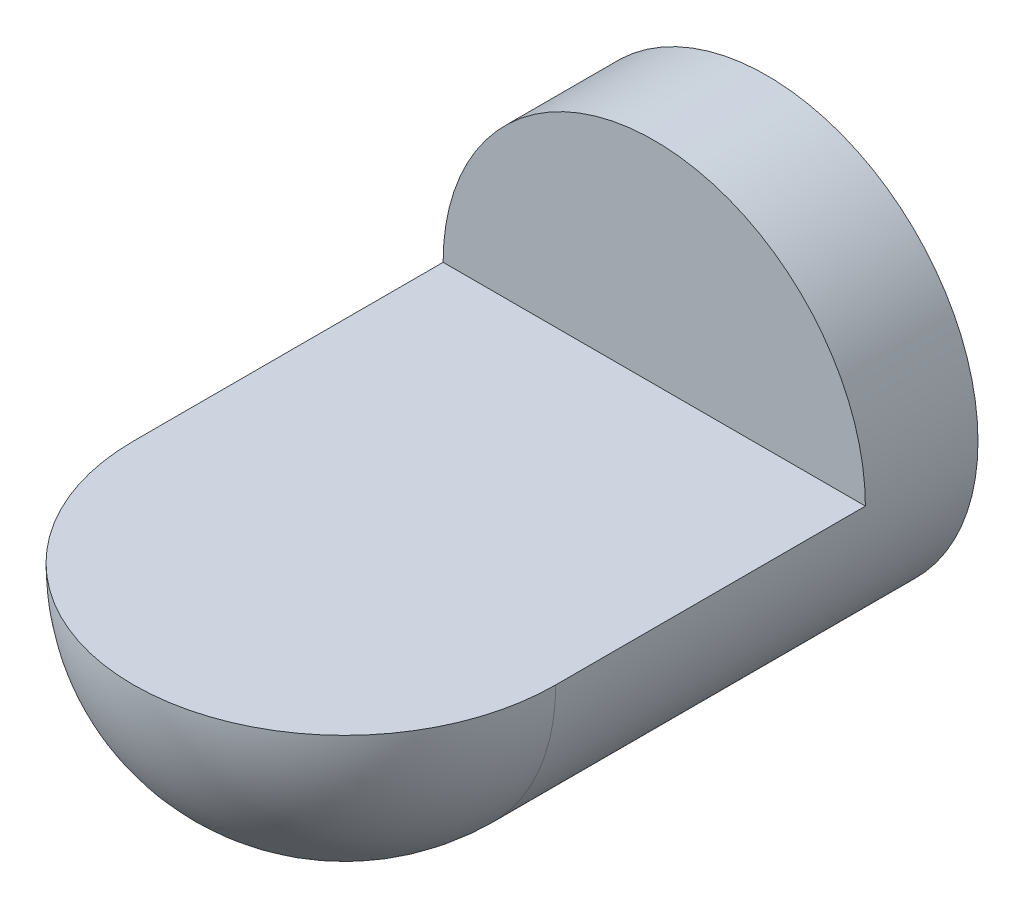
ISO-10303-21;
HEADER;
FILE_DESCRIPTION(('STEP AP214'),'2;1');
FILE_NAME('part.step','',(''),(''),'','','');
FILE_SCHEMA(('AUTOMOTIVE_DESIGN { 1 0 10303 214 1 1 1 1 }'));
ENDSEC;
DATA;
#1=APPLICATION_CONTEXT('core data for automotive mechanical design processes');
#2=APPLICATION_PROTOCOL_DEFINITION('international standard','automotive_design',2000,#1);
#3=PRODUCT_CONTEXT('',#1,'mechanical');
#4=PRODUCT('Part','Part','',(#3));
#5=PRODUCT_RELATED_PRODUCT_CATEGORY('part','',(#4));
#6=PRODUCT_DEFINITION_FORMATION('','',#4);
#7=PRODUCT_DEFINITION_CONTEXT('part definition',#1,'design');
#8=PRODUCT_DEFINITION('design','',#6,#7);
#9=PRODUCT_DEFINITION_SHAPE('','',#8);
#10=(LENGTH_UNIT() NAMED_UNIT(*) SI_UNIT(.MILLI.,.METRE.));
#11=(NAMED_UNIT(*) PLANE_ANGLE_UNIT() SI_UNIT($,.RADIAN.));
#12=(NAMED_UNIT(*) SI_UNIT($,.STERADIAN.) SOLID_ANGLE_UNIT());
#13=UNCERTAINTY_MEASURE_WITH_UNIT(LENGTH_MEASURE(1.E-05),#10,'distance_accuracy_value','');
#14=(GEOMETRIC_REPRESENTATION_CONTEXT(3) GLOBAL_UNCERTAINTY_ASSIGNED_CONTEXT((#13)) GLOBAL_UNIT_ASSIGNED_CONTEXT((#10,
#11,#12)) REPRESENTATION_CONTEXT('',''));
#15=CARTESIAN_POINT('',(0.,0.,0.));
#16=DIRECTION('',(0.,0.,1.));
#17=DIRECTION('',(1.,0.,0.));
#18=AXIS2_PLACEMENT_3D('',#15,#16,#17);
#19=CARTESIAN_POINT('',(0.,0.,0.));
#20=DIRECTION('',(0.,0.,1.));
#21=DIRECTION('',(0.,1.,0.));
#22=AXIS2_PLACEMENT_3D('',#19,#20,#21);
#23=SPHERICAL_SURFACE('',#22,75.);
#24=CARTESIAN_POINT('',(0.,0.,0.));
#25=DIRECTION('',(0.,1.,0.));
#26=DIRECTION('',(0.,0.,1.));
#27=AXIS2_PLACEMENT_3D('',#24,#25,#26);
#28=CIRCLE('',#27,75.);
#29=CARTESIAN_POINT('',(-75.,0.,0.));
#30=VERTEX_POINT('',#29);
#31=CARTESIAN_POINT('',(75.,0.,0.));
#32=VERTEX_POINT('',#31);
#33=EDGE_CURVE('E55',#30,#32,#28,.T.);
#34=ORIENTED_EDGE('',*,*,#33,.F.);
#35=CARTESIAN_POINT('',(0.,0.,0.));
#36=DIRECTION('',(0.,0.,1.));
#37=DIRECTION('',(1.,0.,0.));
#38=AXIS2_PLACEMENT_3D('',#35,#36,#37);
#39=CIRCLE('',#38,75.);
#40=EDGE_CURVE('E76',#30,#32,#39,.T.);
#41=ORIENTED_EDGE('',*,*,#40,.T.);
#42=EDGE_LOOP('',(#34,#41));
#43=FACE_BOUND('',#42,.T.);
#44=ADVANCED_FACE('F36',(#43),#23,.T.);
#45=CARTESIAN_POINT('',(0.,0.,146.909145290857));
#46=DIRECTION('',(0.,0.,1.));
#47=DIRECTION('',(1.,0.,0.));
#48=AXIS2_PLACEMENT_3D('',#45,#46,#47);
#49=CYLINDRICAL_SURFACE('',#48,75.);
#50=CARTESIAN_POINT('',(0.,0.,-150.));
#51=DIRECTION('',(0.,0.,1.));
#52=DIRECTION('',(1.,0.,0.));
#53=AXIS2_PLACEMENT_3D('',#50,#51,#52);
#54=CIRCLE('',#53,75.);
#55=CARTESIAN_POINT('',(75.,0.,-150.));
#56=VERTEX_POINT('',#55);
#57=EDGE_CURVE('E71',#56,#56,#54,.T.);
#58=ORIENTED_EDGE('',*,*,#57,.T.);
#59=EDGE_LOOP('',(#58));
#60=FACE_BOUND('',#59,.T.);
#61=DIRECTION('',(0.,0.,1.));
#62=VECTOR('',#61,1.);
#63=CARTESIAN_POINT('',(75.,0.,146.909145290857));
#64=LINE('',#63,#62);
#65=CARTESIAN_POINT('',(75.,0.,-110.));
#66=VERTEX_POINT('',#65);
#67=EDGE_CURVE('E11',#32,#66,#64,.F.);
#68=ORIENTED_EDGE('',*,*,#67,.F.);
#69=ORIENTED_EDGE('',*,*,#40,.F.);
#70=DIRECTION('',(0.,0.,1.));
#71=VECTOR('',#70,1.);
#72=CARTESIAN_POINT('',(-75.,0.,146.909145290857));
#73=LINE('',#72,#71);
#74=CARTESIAN_POINT('',(-75.,0.,-110.));
#75=VERTEX_POINT('',#74);
#76=EDGE_CURVE('E66',#75,#30,#73,.T.);
#77=ORIENTED_EDGE('',*,*,#76,.F.);
#78=CARTESIAN_POINT('',(0.,0.,-110.));
#79=DIRECTION('',(0.,0.,1.));
#80=DIRECTION('',(1.,0.,0.));
#81=AXIS2_PLACEMENT_3D('',#78,#79,#80);
#82=CIRCLE('',#81,75.);
#83=EDGE_CURVE('E44',#66,#75,#82,.T.);
#84=ORIENTED_EDGE('',*,*,#83,.F.);
#85=EDGE_LOOP('',(#68,#69,#77,#84));
#86=FACE_BOUND('',#85,.T.);
#87=ADVANCED_FACE('F63',(#60,#86),#49,.T.);
#88=CARTESIAN_POINT('',(0.,0.,-150.));
#89=DIRECTION('',(0.,0.,1.));
#90=DIRECTION('',(1.,0.,0.));
#91=AXIS2_PLACEMENT_3D('',#88,#89,#90);
#92=PLANE('',#91);
#93=ORIENTED_EDGE('',*,*,#57,.F.);
#94=EDGE_LOOP('',(#93));
#95=FACE_BOUND('',#94,.T.);
#96=ADVANCED_FACE('F38',(#95),#92,.F.);
#97=CARTESIAN_POINT('',(75.,0.,-110.));
#98=DIRECTION('',(0.,1.,0.));
#99=DIRECTION('',(0.,0.,1.));
#100=AXIS2_PLACEMENT_3D('',#97,#98,#99);
#101=PLANE('',#100);
#102=ORIENTED_EDGE('',*,*,#33,.T.);
#103=ORIENTED_EDGE('',*,*,#67,.T.);
#104=DIRECTION('',(-1.,0.,0.));
#105=VECTOR('',#104,1.);
#106=CARTESIAN_POINT('',(75.,0.,-110.));
#107=LINE('',#106,#105);
#108=EDGE_CURVE('E50',#66,#75,#107,.T.);
#109=ORIENTED_EDGE('',*,*,#108,.T.);
#110=ORIENTED_EDGE('',*,*,#76,.T.);
#111=EDGE_LOOP('',(#102,#103,#109,#110));
#112=FACE_BOUND('',#111,.T.);
#113=ADVANCED_FACE('F68',(#112),#101,.T.);
#114=CARTESIAN_POINT('',(75.,0.,-110.));
#115=DIRECTION('',(0.,0.,1.));
#116=DIRECTION('',(1.,0.,0.));
#117=AXIS2_PLACEMENT_3D('',#114,#115,#116);
#118=PLANE('',#117);
#119=ORIENTED_EDGE('',*,*,#108,.F.);
#120=ORIENTED_EDGE('',*,*,#83,.T.);
#121=EDGE_LOOP('',(#119,#120));
#122=FACE_BOUND('',#121,.T.);
#123=ADVANCED_FACE('F69',(#122),#118,.T.);
#124=CLOSED_SHELL('',(#44,#87,#96,#113,#123));
#125=MANIFOLD_SOLID_BREP('B2',#124);
#126=ADVANCED_BREP_SHAPE_REPRESENTATION('',(#18,#125),#14);
#127=SHAPE_DEFINITION_REPRESENTATION(#9,#126);
ENDSEC;
END-ISO-10303-21;
